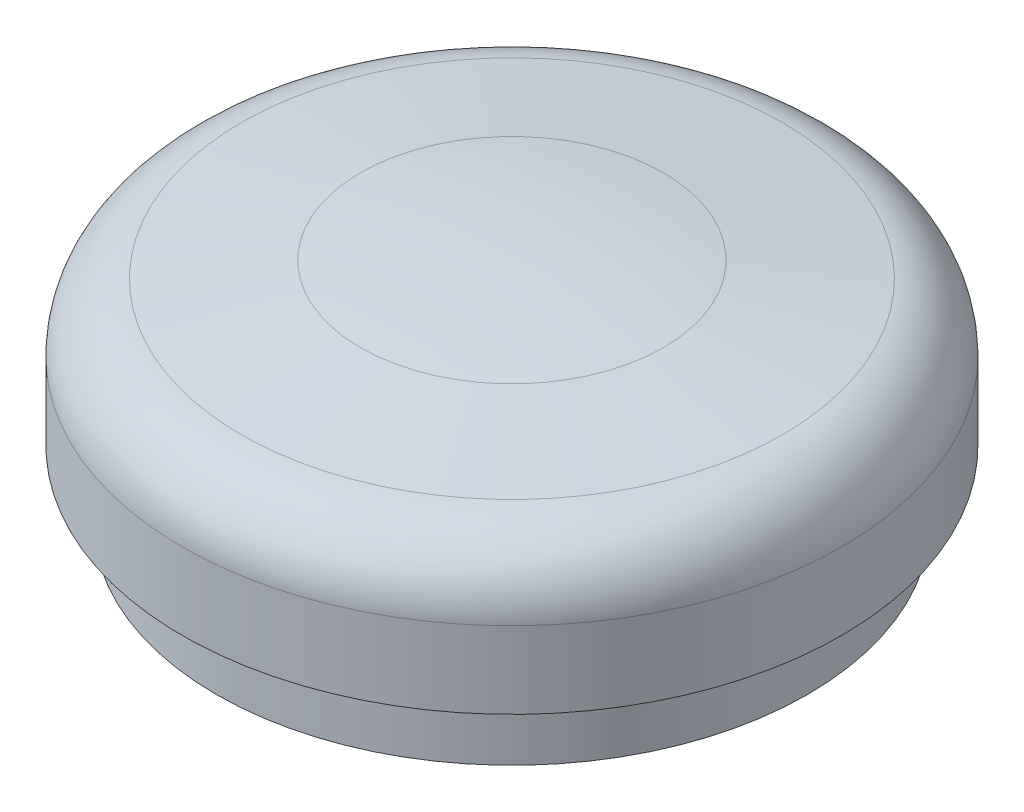
ISO-10303-21;
HEADER;
FILE_DESCRIPTION(('STEP AP214'),'2;1');
FILE_NAME('part.step','',(''),(''),'','','');
FILE_SCHEMA(('AUTOMOTIVE_DESIGN { 1 0 10303 214 1 1 1 1 }'));
ENDSEC;
DATA;
#1=APPLICATION_CONTEXT('core data for automotive mechanical design processes');
#2=APPLICATION_PROTOCOL_DEFINITION('international standard','automotive_design',2000,#1);
#3=PRODUCT_CONTEXT('',#1,'mechanical');
#4=PRODUCT('Part','Part','',(#3));
#5=PRODUCT_RELATED_PRODUCT_CATEGORY('part','',(#4));
#6=PRODUCT_DEFINITION_FORMATION('','',#4);
#7=PRODUCT_DEFINITION_CONTEXT('part definition',#1,'design');
#8=PRODUCT_DEFINITION('design','',#6,#7);
#9=PRODUCT_DEFINITION_SHAPE('','',#8);
#10=(LENGTH_UNIT() NAMED_UNIT(*) SI_UNIT(.MILLI.,.METRE.));
#11=(NAMED_UNIT(*) PLANE_ANGLE_UNIT() SI_UNIT($,.RADIAN.));
#12=(NAMED_UNIT(*) SI_UNIT($,.STERADIAN.) SOLID_ANGLE_UNIT());
#13=UNCERTAINTY_MEASURE_WITH_UNIT(LENGTH_MEASURE(1.E-05),#10,'distance_accuracy_value','');
#14=(GEOMETRIC_REPRESENTATION_CONTEXT(3) GLOBAL_UNCERTAINTY_ASSIGNED_CONTEXT((#13)) GLOBAL_UNIT_ASSIGNED_CONTEXT((#10,
#11,#12)) REPRESENTATION_CONTEXT('',''));
#15=CARTESIAN_POINT('',(0.,0.,0.));
#16=DIRECTION('',(0.,0.,1.));
#17=DIRECTION('',(1.,0.,0.));
#18=AXIS2_PLACEMENT_3D('',#15,#16,#17);
#19=CARTESIAN_POINT('',(4.37775504937853,41.7150090270082,33.5653471087628));
#20=DIRECTION('',(0.,1.,0.));
#21=DIRECTION('',(0.,0.,1.));
#22=AXIS2_PLACEMENT_3D('',#19,#20,#21);
#23=PLANE('',#22);
#24=CARTESIAN_POINT('',(4.37775504937853,41.7150090270082,40.5653471087628));
#25=DIRECTION('',(0.,1.,0.));
#26=DIRECTION('',(0.,0.,1.));
#27=AXIS2_PLACEMENT_3D('',#24,#25,#26);
#28=CIRCLE('',#27,7.7);
#29=CARTESIAN_POINT('',(4.37775504937853,41.7150090270082,48.2653471087628));
#30=VERTEX_POINT('',#29);
#31=EDGE_CURVE('E11',#30,#30,#28,.T.);
#32=ORIENTED_EDGE('',*,*,#31,.F.);
#33=EDGE_LOOP('',(#32));
#34=FACE_BOUND('',#33,.T.);
#35=CARTESIAN_POINT('',(4.37775504937853,41.7150090270082,40.5653471087628));
#36=DIRECTION('',(0.,1.,0.));
#37=DIRECTION('',(0.,0.,1.));
#38=AXIS2_PLACEMENT_3D('',#35,#36,#37);
#39=CIRCLE('',#38,7.);
#40=CARTESIAN_POINT('',(4.37775504937853,41.7150090270082,47.5653471087628));
#41=VERTEX_POINT('',#40);
#42=EDGE_CURVE('E56',#41,#41,#39,.T.);
#43=ORIENTED_EDGE('',*,*,#42,.T.);
#44=EDGE_LOOP('',(#43));
#45=FACE_BOUND('',#44,.T.);
#46=ADVANCED_FACE('F42',(#34,#45),#23,.F.);
#47=CARTESIAN_POINT('',(4.37775504937853,45.4785445662968,40.5653471087628));
#48=DIRECTION('',(0.,1.,0.));
#49=DIRECTION('',(0.,0.,1.));
#50=AXIS2_PLACEMENT_3D('',#47,#48,#49);
#51=CYLINDRICAL_SURFACE('',#50,7.7);
#52=CARTESIAN_POINT('',(4.37775504937853,46.1785445662968,40.5653471087628));
#53=DIRECTION('',(0.,1.,0.));
#54=DIRECTION('',(0.,0.,1.));
#55=AXIS2_PLACEMENT_3D('',#52,#53,#54);
#56=CIRCLE('',#55,7.7);
#57=CARTESIAN_POINT('',(4.37775504937853,46.1785445662968,48.2653471087628));
#58=VERTEX_POINT('',#57);
#59=EDGE_CURVE('E48',#58,#58,#56,.T.);
#60=ORIENTED_EDGE('',*,*,#59,.F.);
#61=EDGE_LOOP('',(#60));
#62=FACE_BOUND('',#61,.T.);
#63=ORIENTED_EDGE('',*,*,#31,.T.);
#64=EDGE_LOOP('',(#63));
#65=FACE_BOUND('',#64,.T.);
#66=ADVANCED_FACE('F77',(#62,#65),#51,.T.);
#67=CARTESIAN_POINT('',(4.37775504937853,46.1785445662968,32.8653471087628));
#68=DIRECTION('',(0.,-1.,0.));
#69=DIRECTION('',(0.,0.,-1.));
#70=AXIS2_PLACEMENT_3D('',#67,#68,#69);
#71=PLANE('',#70);
#72=ORIENTED_EDGE('',*,*,#59,.T.);
#73=EDGE_LOOP('',(#72));
#74=FACE_BOUND('',#73,.T.);
#75=ADVANCED_FACE('F71',(#74),#71,.F.);
#76=CARTESIAN_POINT('',(4.37775504937853,45.4785445662968,33.5653471087628));
#77=DIRECTION('',(0.,1.,0.));
#78=DIRECTION('',(0.,0.,1.));
#79=AXIS2_PLACEMENT_3D('',#76,#77,#78);
#80=PLANE('',#79);
#81=CARTESIAN_POINT('',(4.37775504937853,45.4785445662968,40.5653471087628));
#82=DIRECTION('',(0.,1.,0.));
#83=DIRECTION('',(0.,0.,1.));
#84=AXIS2_PLACEMENT_3D('',#81,#82,#83);
#85=CIRCLE('',#84,7.);
#86=CARTESIAN_POINT('',(4.37775504937853,45.4785445662968,47.5653471087628));
#87=VERTEX_POINT('',#86);
#88=EDGE_CURVE('E52',#87,#87,#85,.T.);
#89=ORIENTED_EDGE('',*,*,#88,.F.);
#90=EDGE_LOOP('',(#89));
#91=FACE_BOUND('',#90,.T.);
#92=ADVANCED_FACE('F66',(#91),#80,.F.);
#93=CARTESIAN_POINT('',(4.37775504937853,45.4785445662968,40.5653471087628));
#94=DIRECTION('',(0.,1.,0.));
#95=DIRECTION('',(0.,0.,1.));
#96=AXIS2_PLACEMENT_3D('',#93,#94,#95);
#97=CYLINDRICAL_SURFACE('',#96,7.);
#98=ORIENTED_EDGE('',*,*,#42,.F.);
#99=EDGE_LOOP('',(#98));
#100=FACE_BOUND('',#99,.T.);
#101=ORIENTED_EDGE('',*,*,#88,.T.);
#102=EDGE_LOOP('',(#101));
#103=FACE_BOUND('',#102,.T.);
#104=ADVANCED_FACE('F63',(#100,#103),#97,.F.);
#105=CLOSED_SHELL('',(#46,#66,#75,#92,#104));
#106=MANIFOLD_SOLID_BREP('B2',#105);
#107=CARTESIAN_POINT('',(4.37775504937853,42.2459714627607,32.5153471087628));
#108=DIRECTION('',(0.,-1.,0.));
#109=DIRECTION('',(0.,0.,-1.));
#110=AXIS2_PLACEMENT_3D('',#107,#108,#109);
#111=PLANE('',#110);
#112=CARTESIAN_POINT('',(4.37775504937853,42.2459714627607,40.5653471087628));
#113=DIRECTION('',(0.,-1.,0.));
#114=DIRECTION('',(0.,0.,-1.));
#115=AXIS2_PLACEMENT_3D('',#112,#113,#114);
#116=CIRCLE('',#115,9.1);
#117=CARTESIAN_POINT('',(4.37775504937853,42.2459714627607,31.4653471087628));
#118=VERTEX_POINT('',#117);
#119=EDGE_CURVE('E41',#118,#118,#116,.T.);
#120=ORIENTED_EDGE('',*,*,#119,.T.);
#121=EDGE_LOOP('',(#120));
#122=FACE_BOUND('',#121,.T.);
#123=CARTESIAN_POINT('',(4.37775504937853,42.2459714627607,40.5653471087628));
#124=DIRECTION('',(0.,-1.,0.));
#125=DIRECTION('',(0.,0.,-1.));
#126=AXIS2_PLACEMENT_3D('',#123,#124,#125);
#127=CIRCLE('',#126,8.05);
#128=CARTESIAN_POINT('',(4.37775504937853,42.2459714627607,32.5153471087628));
#129=VERTEX_POINT('',#128);
#130=EDGE_CURVE('E153',#129,#129,#127,.T.);
#131=ORIENTED_EDGE('',*,*,#130,.F.);
#132=EDGE_LOOP('',(#131));
#133=FACE_BOUND('',#132,.T.);
#134=ADVANCED_FACE('F122',(#122,#133),#111,.T.);
#135=CARTESIAN_POINT('',(4.37775504937853,42.2459714627607,40.5653471087628));
#136=DIRECTION('',(0.,-1.,0.));
#137=DIRECTION('',(0.,0.,-1.));
#138=AXIS2_PLACEMENT_3D('',#135,#136,#137);
#139=CYLINDRICAL_SURFACE('',#138,9.1);
#140=CARTESIAN_POINT('',(4.37775504937853,44.3459714627607,40.5653471087628));
#141=DIRECTION('',(0.,-1.,0.));
#142=DIRECTION('',(0.,0.,-1.));
#143=AXIS2_PLACEMENT_3D('',#140,#141,#142);
#144=CIRCLE('',#143,9.1);
#145=CARTESIAN_POINT('',(4.37775504937853,44.3459714627607,31.4653471087628));
#146=VERTEX_POINT('',#145);
#147=EDGE_CURVE('E128',#146,#146,#144,.T.);
#148=ORIENTED_EDGE('',*,*,#147,.T.);
#149=EDGE_LOOP('',(#148));
#150=FACE_BOUND('',#149,.T.);
#151=ORIENTED_EDGE('',*,*,#119,.F.);
#152=EDGE_LOOP('',(#151));
#153=FACE_BOUND('',#152,.T.);
#154=ADVANCED_FACE('F161',(#150,#153),#139,.T.);
#155=CARTESIAN_POINT('',(4.37775504937853,44.3459714627607,31.4653471087628));
#156=DIRECTION('',(0.,-1.,0.));
#157=DIRECTION('',(0.,0.,-1.));
#158=AXIS2_PLACEMENT_3D('',#155,#156,#157);
#159=PLANE('',#158);
#160=CARTESIAN_POINT('',(4.37775504937853,44.3459714627607,40.5653471087628));
#161=DIRECTION('',(0.,-1.,0.));
#162=DIRECTION('',(0.,0.,-1.));
#163=AXIS2_PLACEMENT_3D('',#160,#161,#162);
#164=CIRCLE('',#163,10.15);
#165=CARTESIAN_POINT('',(4.37775504937853,44.3459714627607,30.4153471087628));
#166=VERTEX_POINT('',#165);
#167=EDGE_CURVE('E132',#166,#166,#164,.T.);
#168=ORIENTED_EDGE('',*,*,#167,.T.);
#169=EDGE_LOOP('',(#168));
#170=FACE_BOUND('',#169,.T.);
#171=ORIENTED_EDGE('',*,*,#147,.F.);
#172=EDGE_LOOP('',(#171));
#173=FACE_BOUND('',#172,.T.);
#174=ADVANCED_FACE('F165',(#170,#173),#159,.T.);
#175=CARTESIAN_POINT('',(4.37775504937853,42.2459714627607,40.5653471087628));
#176=DIRECTION('',(0.,-1.,0.));
#177=DIRECTION('',(0.,0.,-1.));
#178=AXIS2_PLACEMENT_3D('',#175,#176,#177);
#179=CYLINDRICAL_SURFACE('',#178,10.15);
#180=CARTESIAN_POINT('',(4.37775504937853,46.7095070020493,40.5653471087628));
#181=DIRECTION('',(0.,-1.,0.));
#182=DIRECTION('',(0.,0.,-1.));
#183=AXIS2_PLACEMENT_3D('',#180,#181,#182);
#184=CIRCLE('',#183,10.15);
#185=CARTESIAN_POINT('',(4.37775504937853,46.7095070020493,30.4153471087628));
#186=VERTEX_POINT('',#185);
#187=EDGE_CURVE('E136',#186,#186,#184,.T.);
#188=ORIENTED_EDGE('',*,*,#187,.T.);
#189=EDGE_LOOP('',(#188));
#190=FACE_BOUND('',#189,.T.);
#191=ORIENTED_EDGE('',*,*,#167,.F.);
#192=EDGE_LOOP('',(#191));
#193=FACE_BOUND('',#192,.T.);
#194=ADVANCED_FACE('F169',(#190,#193),#179,.T.);
#195=CARTESIAN_POINT('',(4.37775504937853,46.7095070020493,40.5653471087628));
#196=DIRECTION('',(0.,-1.,0.));
#197=DIRECTION('',(0.,0.,-1.));
#198=AXIS2_PLACEMENT_3D('',#195,#196,#197);
#199=TOROIDAL_SURFACE('',#198,8.05,2.1);
#200=CARTESIAN_POINT('',(4.37775504937853,48.790766860344,40.5653471087628));
#201=DIRECTION('',(0.,-1.,0.));
#202=DIRECTION('',(0.,0.,-1.));
#203=AXIS2_PLACEMENT_3D('',#200,#201,#202);
#204=CIRCLE('',#203,8.32992392225543);
#205=CARTESIAN_POINT('',(4.37775504937853,48.790766860344,32.2354231865074));
#206=VERTEX_POINT('',#205);
#207=EDGE_CURVE('E141',#206,#206,#204,.T.);
#208=ORIENTED_EDGE('',*,*,#207,.T.);
#209=EDGE_LOOP('',(#208));
#210=FACE_BOUND('',#209,.T.);
#211=ORIENTED_EDGE('',*,*,#187,.F.);
#212=EDGE_LOOP('',(#211));
#213=FACE_BOUND('',#212,.T.);
#214=ADVANCED_FACE('F176',(#210,#213),#199,.T.);
#215=CARTESIAN_POINT('',(4.37775504937853,48.790766860344,40.5653471087628));
#216=DIRECTION('',(0.,-1.,0.));
#217=DIRECTION('',(0.,0.,-1.));
#218=AXIS2_PLACEMENT_3D('',#215,#216,#217);
#219=CONICAL_SURFACE('',#218,8.32992392225543,1.43710129117294);
#220=CARTESIAN_POINT('',(4.37775504937853,49.2836357676733,40.5653471087628));
#221=DIRECTION('',(0.,-1.,0.));
#222=DIRECTION('',(0.,0.,-1.));
#223=AXIS2_PLACEMENT_3D('',#220,#221,#222);
#224=CIRCLE('',#223,4.66539870425713);
#225=CARTESIAN_POINT('',(4.37775504937853,49.2836357676733,35.8999484045057));
#226=VERTEX_POINT('',#225);
#227=EDGE_CURVE('E144',#226,#226,#224,.T.);
#228=ORIENTED_EDGE('',*,*,#227,.T.);
#229=EDGE_LOOP('',(#228));
#230=FACE_BOUND('',#229,.T.);
#231=ORIENTED_EDGE('',*,*,#207,.F.);
#232=EDGE_LOOP('',(#231));
#233=FACE_BOUND('',#232,.T.);
#234=ADVANCED_FACE('F180',(#230,#233),#219,.T.);
#235=CARTESIAN_POINT('',(4.37775504937853,14.5959714627606,40.5653471087628));
#236=DIRECTION('',(0.,-1.,0.));
#237=DIRECTION('',(0.,0.,-1.));
#238=AXIS2_PLACEMENT_3D('',#235,#236,#237);
#239=SPHERICAL_SURFACE('',#238,35.);
#240=ORIENTED_EDGE('',*,*,#227,.F.);
#241=EDGE_LOOP('',(#240));
#242=FACE_BOUND('',#241,.T.);
#243=ADVANCED_FACE('F184',(#242),#239,.T.);
#244=CARTESIAN_POINT('',(4.37775504937853,14.5959714627606,40.5653471087628));
#245=DIRECTION('',(0.,-1.,0.));
#246=DIRECTION('',(0.,0.,1.));
#247=AXIS2_PLACEMENT_3D('',#244,#245,#246);
#248=SPHERICAL_SURFACE('',#247,33.95);
#249=CARTESIAN_POINT('',(4.37775504937853,48.2430058385259,40.5653471087628));
#250=DIRECTION('',(0.,-1.,0.));
#251=DIRECTION('',(0.,0.,-1.));
#252=AXIS2_PLACEMENT_3D('',#249,#250,#251);
#253=CIRCLE('',#252,4.52543674312941);
#254=CARTESIAN_POINT('',(4.37775504937853,48.2430058385259,36.0399103656334));
#255=VERTEX_POINT('',#254);
#256=EDGE_CURVE('E147',#255,#255,#253,.T.);
#257=ORIENTED_EDGE('',*,*,#256,.T.);
#258=EDGE_LOOP('',(#257));
#259=FACE_BOUND('',#258,.T.);
#260=ADVANCED_FACE('F188',(#259),#248,.F.);
#261=CARTESIAN_POINT('',(4.37775504937853,48.2430058385259,40.5653471087628));
#262=DIRECTION('',(0.,-1.,0.));
#263=DIRECTION('',(0.,0.,-1.));
#264=AXIS2_PLACEMENT_3D('',#261,#262,#263);
#265=CONICAL_SURFACE('',#264,4.52543674312941,1.43710129117294);
#266=CARTESIAN_POINT('',(4.37775504937853,47.7689614431716,40.5653471087628));
#267=DIRECTION('',(0.,-1.,0.));
#268=DIRECTION('',(0.,0.,-1.));
#269=AXIS2_PLACEMENT_3D('',#266,#267,#268);
#270=CIRCLE('',#269,8.05);
#271=CARTESIAN_POINT('',(4.37775504937853,47.7689614431716,32.5153471087628));
#272=VERTEX_POINT('',#271);
#273=EDGE_CURVE('E150',#272,#272,#270,.T.);
#274=ORIENTED_EDGE('',*,*,#273,.T.);
#275=EDGE_LOOP('',(#274));
#276=FACE_BOUND('',#275,.T.);
#277=ORIENTED_EDGE('',*,*,#256,.F.);
#278=EDGE_LOOP('',(#277));
#279=FACE_BOUND('',#278,.T.);
#280=ADVANCED_FACE('F192',(#276,#279),#265,.F.);
#281=CARTESIAN_POINT('',(4.37775504937853,42.2459714627607,40.5653471087628));
#282=DIRECTION('',(0.,-1.,0.));
#283=DIRECTION('',(0.,0.,-1.));
#284=AXIS2_PLACEMENT_3D('',#281,#282,#283);
#285=CYLINDRICAL_SURFACE('',#284,8.05);
#286=ORIENTED_EDGE('',*,*,#130,.T.);
#287=EDGE_LOOP('',(#286));
#288=FACE_BOUND('',#287,.T.);
#289=ORIENTED_EDGE('',*,*,#273,.F.);
#290=EDGE_LOOP('',(#289));
#291=FACE_BOUND('',#290,.T.);
#292=ADVANCED_FACE('F157',(#288,#291),#285,.F.);
#293=CLOSED_SHELL('',(#134,#154,#174,#194,#214,#234,#243,#260,#280,#292));
#294=MANIFOLD_SOLID_BREP('B6',#293);
#295=ADVANCED_BREP_SHAPE_REPRESENTATION('',(#18,#106,#294),#14);
#296=SHAPE_DEFINITION_REPRESENTATION(#9,#295);
ENDSEC;
END-ISO-10303-21;
